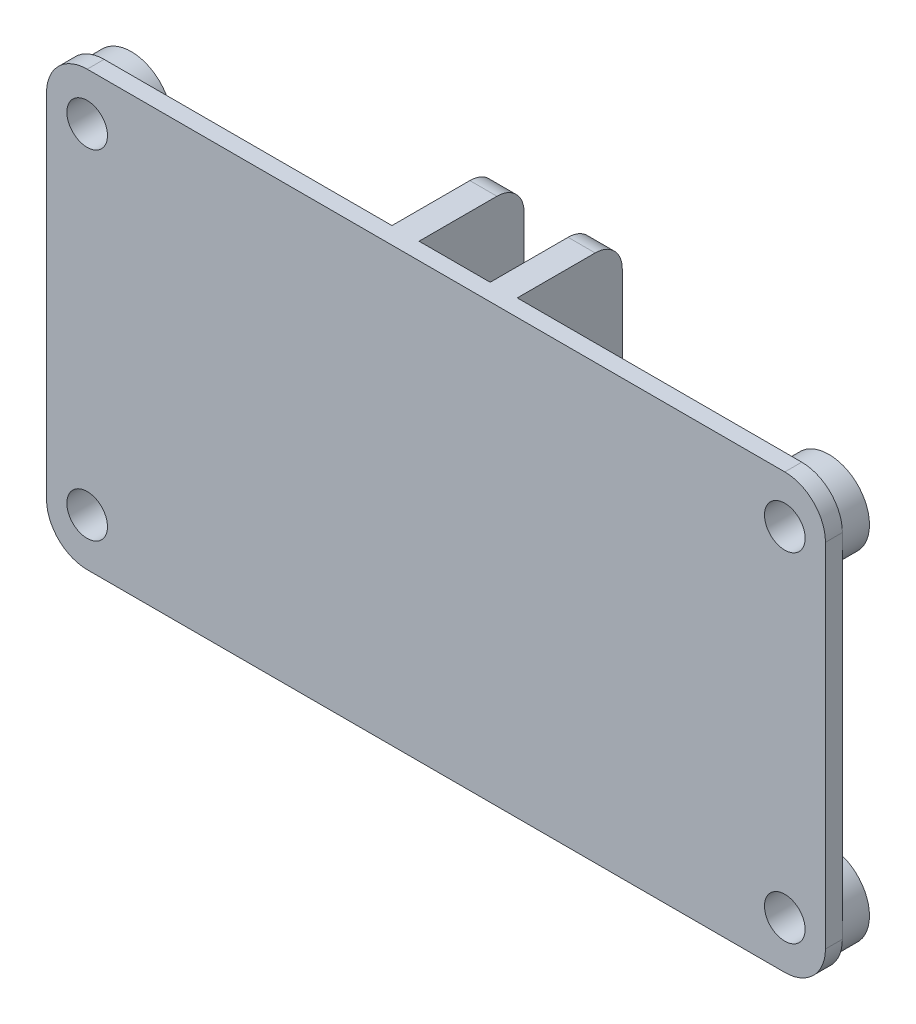
ISO-10303-21;
HEADER;
FILE_DESCRIPTION(('STEP AP214'),'2;1');
FILE_NAME('part.step','',(''),(''),'','','');
FILE_SCHEMA(('AUTOMOTIVE_DESIGN { 1 0 10303 214 1 1 1 1 }'));
ENDSEC;
DATA;
#1=APPLICATION_CONTEXT('core data for automotive mechanical design processes');
#2=APPLICATION_PROTOCOL_DEFINITION('international standard','automotive_design',2000,#1);
#3=PRODUCT_CONTEXT('',#1,'mechanical');
#4=PRODUCT('Part','Part','',(#3));
#5=PRODUCT_RELATED_PRODUCT_CATEGORY('part','',(#4));
#6=PRODUCT_DEFINITION_FORMATION('','',#4);
#7=PRODUCT_DEFINITION_CONTEXT('part definition',#1,'design');
#8=PRODUCT_DEFINITION('design','',#6,#7);
#9=PRODUCT_DEFINITION_SHAPE('','',#8);
#10=(LENGTH_UNIT() NAMED_UNIT(*) SI_UNIT(.MILLI.,.METRE.));
#11=(NAMED_UNIT(*) PLANE_ANGLE_UNIT() SI_UNIT($,.RADIAN.));
#12=(NAMED_UNIT(*) SI_UNIT($,.STERADIAN.) SOLID_ANGLE_UNIT());
#13=UNCERTAINTY_MEASURE_WITH_UNIT(LENGTH_MEASURE(1.E-05),#10,'distance_accuracy_value','');
#14=(GEOMETRIC_REPRESENTATION_CONTEXT(3) GLOBAL_UNCERTAINTY_ASSIGNED_CONTEXT((#13)) GLOBAL_UNIT_ASSIGNED_CONTEXT((#10,
#11,#12)) REPRESENTATION_CONTEXT('',''));
#15=CARTESIAN_POINT('',(0.,0.,0.));
#16=DIRECTION('',(0.,0.,1.));
#17=DIRECTION('',(1.,0.,0.));
#18=AXIS2_PLACEMENT_3D('',#15,#16,#17);
#19=CARTESIAN_POINT('',(0.,0.,9.));
#20=DIRECTION('',(1.,0.,0.));
#21=DIRECTION('',(0.,0.,-1.));
#22=AXIS2_PLACEMENT_3D('',#19,#20,#21);
#23=PLANE('',#22);
#24=DIRECTION('',(0.,1.,0.));
#25=VECTOR('',#24,1.);
#26=CARTESIAN_POINT('',(0.,32.,7.75));
#27=LINE('',#26,#25);
#28=CARTESIAN_POINT('',(0.,3.,7.75));
#29=VERTEX_POINT('',#28);
#30=CARTESIAN_POINT('',(0.,3.5,7.75));
#31=VERTEX_POINT('',#30);
#32=EDGE_CURVE('E214',#29,#31,#27,.T.);
#33=ORIENTED_EDGE('',*,*,#32,.F.);
#34=DIRECTION('',(0.,0.,-1.));
#35=VECTOR('',#34,1.);
#36=CARTESIAN_POINT('',(0.,3.,9.));
#37=LINE('',#36,#35);
#38=CARTESIAN_POINT('',(0.,3.,9.));
#39=VERTEX_POINT('',#38);
#40=EDGE_CURVE('E306',#29,#39,#37,.F.);
#41=ORIENTED_EDGE('',*,*,#40,.T.);
#42=DIRECTION('',(0.,-1.,0.));
#43=VECTOR('',#42,1.);
#44=CARTESIAN_POINT('',(0.,0.,9.));
#45=LINE('',#44,#43);
#46=CARTESIAN_POINT('',(0.,29.,9.));
#47=VERTEX_POINT('',#46);
#48=EDGE_CURVE('E221',#47,#39,#45,.T.);
#49=ORIENTED_EDGE('',*,*,#48,.F.);
#50=DIRECTION('',(0.,0.,-1.));
#51=VECTOR('',#50,1.);
#52=CARTESIAN_POINT('',(0.,29.,9.));
#53=LINE('',#52,#51);
#54=CARTESIAN_POINT('',(0.,29.,7.75));
#55=VERTEX_POINT('',#54);
#56=EDGE_CURVE('E303',#47,#55,#53,.T.);
#57=ORIENTED_EDGE('',*,*,#56,.T.);
#58=CARTESIAN_POINT('',(0.,28.5,7.75));
#59=VERTEX_POINT('',#58);
#60=EDGE_CURVE('E210',#59,#55,#27,.T.);
#61=ORIENTED_EDGE('',*,*,#60,.F.);
#62=EDGE_CURVE('E212',#31,#59,#27,.T.);
#63=ORIENTED_EDGE('',*,*,#62,.F.);
#64=EDGE_LOOP('',(#33,#41,#49,#57,#61,#63));
#65=FACE_BOUND('',#64,.T.);
#66=ADVANCED_FACE('F32',(#65),#23,.F.);
#67=CARTESIAN_POINT('',(57.5,0.,9.));
#68=DIRECTION('',(-1.,0.,0.));
#69=DIRECTION('',(0.,0.,1.));
#70=AXIS2_PLACEMENT_3D('',#67,#68,#69);
#71=PLANE('',#70);
#72=DIRECTION('',(0.,1.,0.));
#73=VECTOR('',#72,1.);
#74=CARTESIAN_POINT('',(57.5,0.,9.));
#75=LINE('',#74,#73);
#76=CARTESIAN_POINT('',(57.5,3.,9.));
#77=VERTEX_POINT('',#76);
#78=CARTESIAN_POINT('',(57.5,29.,9.));
#79=VERTEX_POINT('',#78);
#80=EDGE_CURVE('E280',#77,#79,#75,.T.);
#81=ORIENTED_EDGE('',*,*,#80,.F.);
#82=DIRECTION('',(0.,0.,-1.));
#83=VECTOR('',#82,1.);
#84=CARTESIAN_POINT('',(57.5,3.,9.));
#85=LINE('',#84,#83);
#86=CARTESIAN_POINT('',(57.5,3.,7.75));
#87=VERTEX_POINT('',#86);
#88=EDGE_CURVE('E318',#77,#87,#85,.T.);
#89=ORIENTED_EDGE('',*,*,#88,.T.);
#90=DIRECTION('',(0.,-1.,0.));
#91=VECTOR('',#90,1.);
#92=CARTESIAN_POINT('',(57.5,32.,7.75));
#93=LINE('',#92,#91);
#94=CARTESIAN_POINT('',(57.5,3.5,7.75));
#95=VERTEX_POINT('',#94);
#96=EDGE_CURVE('E228',#95,#87,#93,.T.);
#97=ORIENTED_EDGE('',*,*,#96,.F.);
#98=CARTESIAN_POINT('',(57.5,28.5,7.75));
#99=VERTEX_POINT('',#98);
#100=EDGE_CURVE('E227',#99,#95,#93,.T.);
#101=ORIENTED_EDGE('',*,*,#100,.F.);
#102=CARTESIAN_POINT('',(57.5,29.,7.75));
#103=VERTEX_POINT('',#102);
#104=EDGE_CURVE('E223',#103,#99,#93,.T.);
#105=ORIENTED_EDGE('',*,*,#104,.F.);
#106=DIRECTION('',(0.,0.,-1.));
#107=VECTOR('',#106,1.);
#108=CARTESIAN_POINT('',(57.5,29.,9.));
#109=LINE('',#108,#107);
#110=EDGE_CURVE('E316',#103,#79,#109,.F.);
#111=ORIENTED_EDGE('',*,*,#110,.T.);
#112=EDGE_LOOP('',(#81,#89,#97,#101,#105,#111));
#113=FACE_BOUND('',#112,.T.);
#114=ADVANCED_FACE('F429',(#113),#71,.F.);
#115=CARTESIAN_POINT('',(0.,0.,0.));
#116=DIRECTION('',(0.,0.,-1.));
#117=DIRECTION('',(-1.,0.,0.));
#118=AXIS2_PLACEMENT_3D('',#115,#116,#117);
#119=PLANE('',#118);
#120=DIRECTION('',(0.,1.,0.));
#121=VECTOR('',#120,1.);
#122=CARTESIAN_POINT('',(26.25,32.,0.));
#123=LINE('',#122,#121);
#124=CARTESIAN_POINT('',(26.25,2.,0.));
#125=VERTEX_POINT('',#124);
#126=CARTESIAN_POINT('',(26.25,30.,0.));
#127=VERTEX_POINT('',#126);
#128=EDGE_CURVE('E259',#125,#127,#123,.T.);
#129=ORIENTED_EDGE('',*,*,#128,.F.);
#130=DIRECTION('',(1.,0.,0.));
#131=VECTOR('',#130,1.);
#132=CARTESIAN_POINT('',(24.25,2.,0.));
#133=LINE('',#132,#131);
#134=CARTESIAN_POINT('',(24.25,2.,0.));
#135=VERTEX_POINT('',#134);
#136=EDGE_CURVE('E341',#125,#135,#133,.F.);
#137=ORIENTED_EDGE('',*,*,#136,.T.);
#138=DIRECTION('',(0.,-1.,0.));
#139=VECTOR('',#138,1.);
#140=CARTESIAN_POINT('',(24.25,32.,0.));
#141=LINE('',#140,#139);
#142=CARTESIAN_POINT('',(24.25,30.,0.));
#143=VERTEX_POINT('',#142);
#144=EDGE_CURVE('E203',#143,#135,#141,.T.);
#145=ORIENTED_EDGE('',*,*,#144,.F.);
#146=DIRECTION('',(-1.,0.,0.));
#147=VECTOR('',#146,1.);
#148=CARTESIAN_POINT('',(26.25,30.,0.));
#149=LINE('',#148,#147);
#150=EDGE_CURVE('E339',#143,#127,#149,.F.);
#151=ORIENTED_EDGE('',*,*,#150,.T.);
#152=EDGE_LOOP('',(#129,#137,#145,#151));
#153=FACE_BOUND('',#152,.T.);
#154=ADVANCED_FACE('F435',(#153),#119,.T.);
#155=CARTESIAN_POINT('',(0.,0.,9.));
#156=DIRECTION('',(0.,1.,0.));
#157=DIRECTION('',(0.,0.,1.));
#158=AXIS2_PLACEMENT_3D('',#155,#156,#157);
#159=PLANE('',#158);
#160=DIRECTION('',(0.,0.,-1.));
#161=VECTOR('',#160,1.);
#162=CARTESIAN_POINT('',(24.25,0.,7.75));
#163=LINE('',#162,#161);
#164=CARTESIAN_POINT('',(24.25,0.,7.75));
#165=VERTEX_POINT('',#164);
#166=CARTESIAN_POINT('',(24.25,0.,2.));
#167=VERTEX_POINT('',#166);
#168=EDGE_CURVE('E181',#165,#167,#163,.T.);
#169=ORIENTED_EDGE('',*,*,#168,.T.);
#170=DIRECTION('',(1.,0.,0.));
#171=VECTOR('',#170,1.);
#172=CARTESIAN_POINT('',(26.25,0.,2.));
#173=LINE('',#172,#171);
#174=CARTESIAN_POINT('',(26.25,0.,2.));
#175=VERTEX_POINT('',#174);
#176=EDGE_CURVE('E333',#167,#175,#173,.T.);
#177=ORIENTED_EDGE('',*,*,#176,.T.);
#178=DIRECTION('',(0.,0.,-1.));
#179=VECTOR('',#178,1.);
#180=CARTESIAN_POINT('',(26.25,0.,7.75));
#181=LINE('',#180,#179);
#182=CARTESIAN_POINT('',(26.25,0.,7.75));
#183=VERTEX_POINT('',#182);
#184=EDGE_CURVE('E240',#183,#175,#181,.T.);
#185=ORIENTED_EDGE('',*,*,#184,.F.);
#186=DIRECTION('',(-1.,0.,0.));
#187=VECTOR('',#186,1.);
#188=CARTESIAN_POINT('',(26.25,0.,7.75));
#189=LINE('',#188,#187);
#190=CARTESIAN_POINT('',(31.5,0.,7.75));
#191=VERTEX_POINT('',#190);
#192=EDGE_CURVE('E255',#191,#183,#189,.T.);
#193=ORIENTED_EDGE('',*,*,#192,.F.);
#194=DIRECTION('',(0.,0.,-1.));
#195=VECTOR('',#194,1.);
#196=CARTESIAN_POINT('',(31.5,0.,7.75));
#197=LINE('',#196,#195);
#198=CARTESIAN_POINT('',(31.5,0.,2.));
#199=VERTEX_POINT('',#198);
#200=EDGE_CURVE('E267',#191,#199,#197,.T.);
#201=ORIENTED_EDGE('',*,*,#200,.T.);
#202=DIRECTION('',(1.,0.,0.));
#203=VECTOR('',#202,1.);
#204=CARTESIAN_POINT('',(33.5,0.,2.));
#205=LINE('',#204,#203);
#206=CARTESIAN_POINT('',(33.5,0.,2.));
#207=VERTEX_POINT('',#206);
#208=EDGE_CURVE('E330',#199,#207,#205,.T.);
#209=ORIENTED_EDGE('',*,*,#208,.T.);
#210=DIRECTION('',(0.,0.,-1.));
#211=VECTOR('',#210,1.);
#212=CARTESIAN_POINT('',(33.5,0.,7.75));
#213=LINE('',#212,#211);
#214=CARTESIAN_POINT('',(33.5,0.,7.75));
#215=VERTEX_POINT('',#214);
#216=EDGE_CURVE('E236',#215,#207,#213,.T.);
#217=ORIENTED_EDGE('',*,*,#216,.F.);
#218=DIRECTION('',(-1.,0.,0.));
#219=VECTOR('',#218,1.);
#220=CARTESIAN_POINT('',(57.5,0.,7.75));
#221=LINE('',#220,#219);
#222=CARTESIAN_POINT('',(54.5,0.,7.75));
#223=VERTEX_POINT('',#222);
#224=EDGE_CURVE('E226',#223,#215,#221,.T.);
#225=ORIENTED_EDGE('',*,*,#224,.F.);
#226=DIRECTION('',(0.,0.,-1.));
#227=VECTOR('',#226,1.);
#228=CARTESIAN_POINT('',(54.5,0.,9.));
#229=LINE('',#228,#227);
#230=CARTESIAN_POINT('',(54.5,0.,9.));
#231=VERTEX_POINT('',#230);
#232=EDGE_CURVE('E286',#223,#231,#229,.F.);
#233=ORIENTED_EDGE('',*,*,#232,.T.);
#234=DIRECTION('',(1.,0.,0.));
#235=VECTOR('',#234,1.);
#236=CARTESIAN_POINT('',(0.,0.,9.));
#237=LINE('',#236,#235);
#238=CARTESIAN_POINT('',(3.,0.,9.));
#239=VERTEX_POINT('',#238);
#240=EDGE_CURVE('E277',#239,#231,#237,.T.);
#241=ORIENTED_EDGE('',*,*,#240,.F.);
#242=DIRECTION('',(0.,0.,-1.));
#243=VECTOR('',#242,1.);
#244=CARTESIAN_POINT('',(3.,0.,9.));
#245=LINE('',#244,#243);
#246=CARTESIAN_POINT('',(3.00000000000001,0.,7.75));
#247=VERTEX_POINT('',#246);
#248=EDGE_CURVE('E209',#239,#247,#245,.T.);
#249=ORIENTED_EDGE('',*,*,#248,.T.);
#250=DIRECTION('',(-1.,0.,0.));
#251=VECTOR('',#250,1.);
#252=CARTESIAN_POINT('',(24.25,0.,7.75));
#253=LINE('',#252,#251);
#254=EDGE_CURVE('E201',#165,#247,#253,.T.);
#255=ORIENTED_EDGE('',*,*,#254,.F.);
#256=EDGE_LOOP('',(#169,#177,#185,#193,#201,#209,#217,#225,#233,#241,#249,#255));
#257=FACE_BOUND('',#256,.T.);
#258=ADVANCED_FACE('F206',(#257),#159,.F.);
#259=CARTESIAN_POINT('',(0.,32.,9.));
#260=DIRECTION('',(0.,-1.,0.));
#261=DIRECTION('',(0.,0.,-1.));
#262=AXIS2_PLACEMENT_3D('',#259,#260,#261);
#263=PLANE('',#262);
#264=DIRECTION('',(0.,0.,-1.));
#265=VECTOR('',#264,1.);
#266=CARTESIAN_POINT('',(26.25,32.,7.75));
#267=LINE('',#266,#265);
#268=CARTESIAN_POINT('',(26.25,32.,7.75));
#269=VERTEX_POINT('',#268);
#270=CARTESIAN_POINT('',(26.25,32.,2.));
#271=VERTEX_POINT('',#270);
#272=EDGE_CURVE('E258',#269,#271,#267,.T.);
#273=ORIENTED_EDGE('',*,*,#272,.T.);
#274=DIRECTION('',(-1.,0.,0.));
#275=VECTOR('',#274,1.);
#276=CARTESIAN_POINT('',(24.25,32.,2.));
#277=LINE('',#276,#275);
#278=CARTESIAN_POINT('',(24.25,32.,2.));
#279=VERTEX_POINT('',#278);
#280=EDGE_CURVE('E11',#271,#279,#277,.T.);
#281=ORIENTED_EDGE('',*,*,#280,.T.);
#282=DIRECTION('',(0.,0.,-1.));
#283=VECTOR('',#282,1.);
#284=CARTESIAN_POINT('',(24.25,32.,7.75));
#285=LINE('',#284,#283);
#286=CARTESIAN_POINT('',(24.25,32.,7.75));
#287=VERTEX_POINT('',#286);
#288=EDGE_CURVE('E194',#287,#279,#285,.T.);
#289=ORIENTED_EDGE('',*,*,#288,.F.);
#290=DIRECTION('',(1.,0.,0.));
#291=VECTOR('',#290,1.);
#292=CARTESIAN_POINT('',(24.25,32.,7.75));
#293=LINE('',#292,#291);
#294=CARTESIAN_POINT('',(3.00000000000001,32.,7.75));
#295=VERTEX_POINT('',#294);
#296=EDGE_CURVE('E195',#295,#287,#293,.T.);
#297=ORIENTED_EDGE('',*,*,#296,.F.);
#298=DIRECTION('',(0.,0.,-1.));
#299=VECTOR('',#298,1.);
#300=CARTESIAN_POINT('',(3.,32.,9.));
#301=LINE('',#300,#299);
#302=CARTESIAN_POINT('',(3.,32.,9.));
#303=VERTEX_POINT('',#302);
#304=EDGE_CURVE('E328',#295,#303,#301,.F.);
#305=ORIENTED_EDGE('',*,*,#304,.T.);
#306=DIRECTION('',(-1.,0.,0.));
#307=VECTOR('',#306,1.);
#308=CARTESIAN_POINT('',(0.,32.,9.));
#309=LINE('',#308,#307);
#310=CARTESIAN_POINT('',(54.5,32.,9.));
#311=VERTEX_POINT('',#310);
#312=EDGE_CURVE('E283',#311,#303,#309,.T.);
#313=ORIENTED_EDGE('',*,*,#312,.F.);
#314=DIRECTION('',(0.,0.,-1.));
#315=VECTOR('',#314,1.);
#316=CARTESIAN_POINT('',(54.5,32.,9.));
#317=LINE('',#316,#315);
#318=CARTESIAN_POINT('',(54.5,32.,7.75));
#319=VERTEX_POINT('',#318);
#320=EDGE_CURVE('E325',#311,#319,#317,.T.);
#321=ORIENTED_EDGE('',*,*,#320,.T.);
#322=DIRECTION('',(1.,0.,0.));
#323=VECTOR('',#322,1.);
#324=CARTESIAN_POINT('',(57.5,32.,7.75));
#325=LINE('',#324,#323);
#326=CARTESIAN_POINT('',(33.5,32.,7.75));
#327=VERTEX_POINT('',#326);
#328=EDGE_CURVE('E233',#327,#319,#325,.T.);
#329=ORIENTED_EDGE('',*,*,#328,.F.);
#330=DIRECTION('',(0.,0.,-1.));
#331=VECTOR('',#330,1.);
#332=CARTESIAN_POINT('',(33.5,32.,7.75));
#333=LINE('',#332,#331);
#334=CARTESIAN_POINT('',(33.5,32.,2.));
#335=VERTEX_POINT('',#334);
#336=EDGE_CURVE('E220',#327,#335,#333,.T.);
#337=ORIENTED_EDGE('',*,*,#336,.T.);
#338=DIRECTION('',(-1.,0.,0.));
#339=VECTOR('',#338,1.);
#340=CARTESIAN_POINT('',(31.5,32.,2.));
#341=LINE('',#340,#339);
#342=CARTESIAN_POINT('',(31.5,32.,2.));
#343=VERTEX_POINT('',#342);
#344=EDGE_CURVE('E41',#335,#343,#341,.T.);
#345=ORIENTED_EDGE('',*,*,#344,.T.);
#346=DIRECTION('',(0.,0.,-1.));
#347=VECTOR('',#346,1.);
#348=CARTESIAN_POINT('',(31.5,32.,7.75));
#349=LINE('',#348,#347);
#350=CARTESIAN_POINT('',(31.5,32.,7.75));
#351=VERTEX_POINT('',#350);
#352=EDGE_CURVE('E270',#351,#343,#349,.T.);
#353=ORIENTED_EDGE('',*,*,#352,.F.);
#354=DIRECTION('',(1.,0.,0.));
#355=VECTOR('',#354,1.);
#356=CARTESIAN_POINT('',(26.25,32.,7.75));
#357=LINE('',#356,#355);
#358=EDGE_CURVE('E248',#269,#351,#357,.T.);
#359=ORIENTED_EDGE('',*,*,#358,.F.);
#360=EDGE_LOOP('',(#273,#281,#289,#297,#305,#313,#321,#329,#337,#345,#353,#359));
#361=FACE_BOUND('',#360,.T.);
#362=ADVANCED_FACE('F478',(#361),#263,.F.);
#363=CARTESIAN_POINT('',(0.,0.,9.));
#364=DIRECTION('',(0.,0.,-1.));
#365=DIRECTION('',(-1.,0.,0.));
#366=AXIS2_PLACEMENT_3D('',#363,#364,#365);
#367=PLANE('',#366);
#368=CARTESIAN_POINT('',(54.5,3.5,9.));
#369=DIRECTION('',(0.,0.,-1.));
#370=DIRECTION('',(-1.,0.,0.));
#371=AXIS2_PLACEMENT_3D('',#368,#369,#370);
#372=CIRCLE('',#371,1.5);
#373=CARTESIAN_POINT('',(53.,3.5,9.));
#374=VERTEX_POINT('',#373);
#375=EDGE_CURVE('E724',#374,#374,#372,.T.);
#376=ORIENTED_EDGE('',*,*,#375,.T.);
#377=EDGE_LOOP('',(#376));
#378=FACE_BOUND('',#377,.T.);
#379=CARTESIAN_POINT('',(3.,3.5,9.));
#380=DIRECTION('',(0.,0.,-1.));
#381=DIRECTION('',(-1.,0.,0.));
#382=AXIS2_PLACEMENT_3D('',#379,#380,#381);
#383=CIRCLE('',#382,1.5);
#384=CARTESIAN_POINT('',(1.5,3.5,9.));
#385=VERTEX_POINT('',#384);
#386=EDGE_CURVE('E721',#385,#385,#383,.T.);
#387=ORIENTED_EDGE('',*,*,#386,.T.);
#388=EDGE_LOOP('',(#387));
#389=FACE_BOUND('',#388,.T.);
#390=CARTESIAN_POINT('',(3.,28.5,9.));
#391=DIRECTION('',(0.,0.,-1.));
#392=DIRECTION('',(-1.,0.,0.));
#393=AXIS2_PLACEMENT_3D('',#390,#391,#392);
#394=CIRCLE('',#393,1.5);
#395=CARTESIAN_POINT('',(1.5,28.5,9.));
#396=VERTEX_POINT('',#395);
#397=EDGE_CURVE('E719',#396,#396,#394,.T.);
#398=ORIENTED_EDGE('',*,*,#397,.T.);
#399=EDGE_LOOP('',(#398));
#400=FACE_BOUND('',#399,.T.);
#401=CARTESIAN_POINT('',(54.5,28.5,9.));
#402=DIRECTION('',(0.,0.,-1.));
#403=DIRECTION('',(-1.,0.,0.));
#404=AXIS2_PLACEMENT_3D('',#401,#402,#403);
#405=CIRCLE('',#404,1.5);
#406=CARTESIAN_POINT('',(53.,28.5,9.));
#407=VERTEX_POINT('',#406);
#408=EDGE_CURVE('E364',#407,#407,#405,.T.);
#409=ORIENTED_EDGE('',*,*,#408,.T.);
#410=EDGE_LOOP('',(#409));
#411=FACE_BOUND('',#410,.T.);
#412=ORIENTED_EDGE('',*,*,#48,.T.);
#413=CARTESIAN_POINT('',(3.,3.,9.));
#414=DIRECTION('',(0.,0.,-1.));
#415=DIRECTION('',(-1.,0.,0.));
#416=AXIS2_PLACEMENT_3D('',#413,#414,#415);
#417=CIRCLE('',#416,3.);
#418=EDGE_CURVE('E314',#39,#239,#417,.F.);
#419=ORIENTED_EDGE('',*,*,#418,.T.);
#420=ORIENTED_EDGE('',*,*,#240,.T.);
#421=CARTESIAN_POINT('',(54.5,3.,9.));
#422=DIRECTION('',(0.,0.,-1.));
#423=DIRECTION('',(-1.,0.,0.));
#424=AXIS2_PLACEMENT_3D('',#421,#422,#423);
#425=CIRCLE('',#424,3.);
#426=EDGE_CURVE('E312',#231,#77,#425,.F.);
#427=ORIENTED_EDGE('',*,*,#426,.T.);
#428=ORIENTED_EDGE('',*,*,#80,.T.);
#429=CARTESIAN_POINT('',(54.5,29.,9.));
#430=DIRECTION('',(0.,0.,-1.));
#431=DIRECTION('',(-1.,0.,0.));
#432=AXIS2_PLACEMENT_3D('',#429,#430,#431);
#433=CIRCLE('',#432,3.);
#434=EDGE_CURVE('E308',#79,#311,#433,.F.);
#435=ORIENTED_EDGE('',*,*,#434,.T.);
#436=ORIENTED_EDGE('',*,*,#312,.T.);
#437=CARTESIAN_POINT('',(3.,29.,9.));
#438=DIRECTION('',(0.,0.,-1.));
#439=DIRECTION('',(-1.,0.,0.));
#440=AXIS2_PLACEMENT_3D('',#437,#438,#439);
#441=CIRCLE('',#440,3.);
#442=EDGE_CURVE('E310',#303,#47,#441,.F.);
#443=ORIENTED_EDGE('',*,*,#442,.T.);
#444=EDGE_LOOP('',(#412,#419,#420,#427,#428,#435,#436,#443));
#445=FACE_BOUND('',#444,.T.);
#446=ADVANCED_FACE('F494',(#378,#389,#400,#411,#445),#367,.F.);
#447=DIRECTION('',(0.,1.,0.));
#448=VECTOR('',#447,1.);
#449=CARTESIAN_POINT('',(33.5,32.,0.));
#450=LINE('',#449,#448);
#451=CARTESIAN_POINT('',(33.5,2.,0.));
#452=VERTEX_POINT('',#451);
#453=CARTESIAN_POINT('',(33.5,30.,0.));
#454=VERTEX_POINT('',#453);
#455=EDGE_CURVE('E237',#452,#454,#450,.T.);
#456=ORIENTED_EDGE('',*,*,#455,.F.);
#457=DIRECTION('',(1.,0.,0.));
#458=VECTOR('',#457,1.);
#459=CARTESIAN_POINT('',(31.5,2.,0.));
#460=LINE('',#459,#458);
#461=CARTESIAN_POINT('',(31.5,2.,0.));
#462=VERTEX_POINT('',#461);
#463=EDGE_CURVE('E352',#452,#462,#460,.F.);
#464=ORIENTED_EDGE('',*,*,#463,.T.);
#465=DIRECTION('',(0.,-1.,0.));
#466=VECTOR('',#465,1.);
#467=CARTESIAN_POINT('',(31.5,32.,0.));
#468=LINE('',#467,#466);
#469=CARTESIAN_POINT('',(31.5,30.,0.));
#470=VERTEX_POINT('',#469);
#471=EDGE_CURVE('E249',#470,#462,#468,.T.);
#472=ORIENTED_EDGE('',*,*,#471,.F.);
#473=DIRECTION('',(-1.,0.,0.));
#474=VECTOR('',#473,1.);
#475=CARTESIAN_POINT('',(33.5,30.,0.));
#476=LINE('',#475,#474);
#477=EDGE_CURVE('E350',#470,#454,#476,.F.);
#478=ORIENTED_EDGE('',*,*,#477,.T.);
#479=EDGE_LOOP('',(#456,#464,#472,#478));
#480=FACE_BOUND('',#479,.T.);
#481=ADVANCED_FACE('F525',(#480),#119,.T.);
#482=CARTESIAN_POINT('',(26.25,32.,7.75));
#483=DIRECTION('',(-1.,0.,0.));
#484=DIRECTION('',(0.,0.,1.));
#485=AXIS2_PLACEMENT_3D('',#482,#483,#484);
#486=PLANE('',#485);
#487=CARTESIAN_POINT('',(26.25,10.,3.5));
#488=DIRECTION('',(-1.,0.,0.));
#489=DIRECTION('',(0.,0.,1.));
#490=AXIS2_PLACEMENT_3D('',#487,#488,#489);
#491=CIRCLE('',#490,1.55000000000002);
#492=CARTESIAN_POINT('',(26.25,10.,5.05000000000002));
#493=VERTEX_POINT('',#492);
#494=EDGE_CURVE('E262',#493,#493,#491,.T.);
#495=ORIENTED_EDGE('',*,*,#494,.T.);
#496=EDGE_LOOP('',(#495));
#497=FACE_BOUND('',#496,.T.);
#498=CARTESIAN_POINT('',(26.25,20.,3.5));
#499=DIRECTION('',(-1.,0.,0.));
#500=DIRECTION('',(0.,0.,1.));
#501=AXIS2_PLACEMENT_3D('',#498,#499,#500);
#502=CIRCLE('',#501,1.55000000000002);
#503=CARTESIAN_POINT('',(26.25,20.,5.05000000000002));
#504=VERTEX_POINT('',#503);
#505=EDGE_CURVE('E296',#504,#504,#502,.T.);
#506=ORIENTED_EDGE('',*,*,#505,.T.);
#507=EDGE_LOOP('',(#506));
#508=FACE_BOUND('',#507,.T.);
#509=ORIENTED_EDGE('',*,*,#184,.T.);
#510=CARTESIAN_POINT('',(26.25,2.,2.));
#511=DIRECTION('',(-1.,0.,0.));
#512=DIRECTION('',(0.,0.,1.));
#513=AXIS2_PLACEMENT_3D('',#510,#511,#512);
#514=CIRCLE('',#513,2.);
#515=EDGE_CURVE('E337',#175,#125,#514,.F.);
#516=ORIENTED_EDGE('',*,*,#515,.T.);
#517=ORIENTED_EDGE('',*,*,#128,.T.);
#518=CARTESIAN_POINT('',(26.25,30.,2.));
#519=DIRECTION('',(-1.,0.,0.));
#520=DIRECTION('',(0.,0.,1.));
#521=AXIS2_PLACEMENT_3D('',#518,#519,#520);
#522=CIRCLE('',#521,2.);
#523=EDGE_CURVE('E335',#127,#271,#522,.F.);
#524=ORIENTED_EDGE('',*,*,#523,.T.);
#525=ORIENTED_EDGE('',*,*,#272,.F.);
#526=DIRECTION('',(0.,1.,0.));
#527=VECTOR('',#526,1.);
#528=CARTESIAN_POINT('',(26.25,32.,7.75));
#529=LINE('',#528,#527);
#530=EDGE_CURVE('E245',#183,#269,#529,.T.);
#531=ORIENTED_EDGE('',*,*,#530,.F.);
#532=EDGE_LOOP('',(#509,#516,#517,#524,#525,#531));
#533=FACE_BOUND('',#532,.T.);
#534=ADVANCED_FACE('F406',(#497,#508,#533),#486,.F.);
#535=CARTESIAN_POINT('',(31.5,32.,7.75));
#536=DIRECTION('',(1.,0.,0.));
#537=DIRECTION('',(0.,1.,0.));
#538=AXIS2_PLACEMENT_3D('',#535,#536,#537);
#539=PLANE('',#538);
#540=CARTESIAN_POINT('',(31.5,10.,3.5));
#541=DIRECTION('',(1.,0.,0.));
#542=DIRECTION('',(0.,1.,0.));
#543=AXIS2_PLACEMENT_3D('',#540,#541,#542);
#544=CIRCLE('',#543,1.55000000000002);
#545=CARTESIAN_POINT('',(31.5,11.55,3.5));
#546=VERTEX_POINT('',#545);
#547=EDGE_CURVE('E295',#546,#546,#544,.T.);
#548=ORIENTED_EDGE('',*,*,#547,.T.);
#549=EDGE_LOOP('',(#548));
#550=FACE_BOUND('',#549,.T.);
#551=CARTESIAN_POINT('',(31.5,20.,3.5));
#552=DIRECTION('',(1.,0.,0.));
#553=DIRECTION('',(0.,1.,0.));
#554=AXIS2_PLACEMENT_3D('',#551,#552,#553);
#555=CIRCLE('',#554,1.55000000000002);
#556=CARTESIAN_POINT('',(31.5,21.55,3.5));
#557=VERTEX_POINT('',#556);
#558=EDGE_CURVE('E290',#557,#557,#555,.T.);
#559=ORIENTED_EDGE('',*,*,#558,.T.);
#560=EDGE_LOOP('',(#559));
#561=FACE_BOUND('',#560,.T.);
#562=ORIENTED_EDGE('',*,*,#471,.T.);
#563=CARTESIAN_POINT('',(31.5,2.,2.));
#564=DIRECTION('',(1.,0.,0.));
#565=DIRECTION('',(0.,1.,0.));
#566=AXIS2_PLACEMENT_3D('',#563,#564,#565);
#567=CIRCLE('',#566,2.);
#568=EDGE_CURVE('E356',#462,#199,#567,.F.);
#569=ORIENTED_EDGE('',*,*,#568,.T.);
#570=ORIENTED_EDGE('',*,*,#200,.F.);
#571=DIRECTION('',(0.,-1.,0.));
#572=VECTOR('',#571,1.);
#573=CARTESIAN_POINT('',(31.5,32.,7.75));
#574=LINE('',#573,#572);
#575=EDGE_CURVE('E252',#351,#191,#574,.T.);
#576=ORIENTED_EDGE('',*,*,#575,.F.);
#577=ORIENTED_EDGE('',*,*,#352,.T.);
#578=CARTESIAN_POINT('',(31.5,30.,2.));
#579=DIRECTION('',(1.,0.,0.));
#580=DIRECTION('',(0.,1.,0.));
#581=AXIS2_PLACEMENT_3D('',#578,#579,#580);
#582=CIRCLE('',#581,2.);
#583=EDGE_CURVE('E354',#343,#470,#582,.F.);
#584=ORIENTED_EDGE('',*,*,#583,.T.);
#585=EDGE_LOOP('',(#562,#569,#570,#576,#577,#584));
#586=FACE_BOUND('',#585,.T.);
#587=ADVANCED_FACE('F530',(#550,#561,#586),#539,.F.);
#588=CARTESIAN_POINT('',(0.,0.,7.75));
#589=DIRECTION('',(0.,0.,1.));
#590=DIRECTION('',(1.,0.,0.));
#591=AXIS2_PLACEMENT_3D('',#588,#589,#590);
#592=PLANE('',#591);
#593=ORIENTED_EDGE('',*,*,#530,.T.);
#594=ORIENTED_EDGE('',*,*,#358,.T.);
#595=ORIENTED_EDGE('',*,*,#575,.T.);
#596=ORIENTED_EDGE('',*,*,#192,.T.);
#597=EDGE_LOOP('',(#593,#594,#595,#596));
#598=FACE_BOUND('',#597,.T.);
#599=ADVANCED_FACE('F481',(#598),#592,.F.);
#600=CARTESIAN_POINT('',(33.5,32.,7.75));
#601=DIRECTION('',(-1.,0.,0.));
#602=DIRECTION('',(0.,0.,1.));
#603=AXIS2_PLACEMENT_3D('',#600,#601,#602);
#604=PLANE('',#603);
#605=CARTESIAN_POINT('',(33.5,10.,3.5));
#606=DIRECTION('',(1.,0.,0.));
#607=DIRECTION('',(0.,1.,0.));
#608=AXIS2_PLACEMENT_3D('',#605,#606,#607);
#609=CIRCLE('',#608,1.55000000000002);
#610=CARTESIAN_POINT('',(33.5,11.55,3.5));
#611=VERTEX_POINT('',#610);
#612=EDGE_CURVE('E291',#611,#611,#609,.T.);
#613=ORIENTED_EDGE('',*,*,#612,.F.);
#614=EDGE_LOOP('',(#613));
#615=FACE_BOUND('',#614,.T.);
#616=CARTESIAN_POINT('',(33.5,20.,3.5));
#617=DIRECTION('',(1.,0.,0.));
#618=DIRECTION('',(0.,1.,0.));
#619=AXIS2_PLACEMENT_3D('',#616,#617,#618);
#620=CIRCLE('',#619,1.55000000000002);
#621=CARTESIAN_POINT('',(33.5,21.55,3.5));
#622=VERTEX_POINT('',#621);
#623=EDGE_CURVE('E392',#622,#622,#620,.T.);
#624=ORIENTED_EDGE('',*,*,#623,.F.);
#625=EDGE_LOOP('',(#624));
#626=FACE_BOUND('',#625,.T.);
#627=ORIENTED_EDGE('',*,*,#216,.T.);
#628=CARTESIAN_POINT('',(33.5,2.,2.));
#629=DIRECTION('',(-1.,0.,0.));
#630=DIRECTION('',(0.,0.,1.));
#631=AXIS2_PLACEMENT_3D('',#628,#629,#630);
#632=CIRCLE('',#631,2.);
#633=EDGE_CURVE('E348',#207,#452,#632,.F.);
#634=ORIENTED_EDGE('',*,*,#633,.T.);
#635=ORIENTED_EDGE('',*,*,#455,.T.);
#636=CARTESIAN_POINT('',(33.5,30.,2.));
#637=DIRECTION('',(-1.,0.,0.));
#638=DIRECTION('',(0.,0.,1.));
#639=AXIS2_PLACEMENT_3D('',#636,#637,#638);
#640=CIRCLE('',#639,2.);
#641=EDGE_CURVE('E346',#454,#335,#640,.F.);
#642=ORIENTED_EDGE('',*,*,#641,.T.);
#643=ORIENTED_EDGE('',*,*,#336,.F.);
#644=DIRECTION('',(0.,1.,0.));
#645=VECTOR('',#644,1.);
#646=CARTESIAN_POINT('',(33.5,32.,7.75));
#647=LINE('',#646,#645);
#648=EDGE_CURVE('E230',#215,#327,#647,.T.);
#649=ORIENTED_EDGE('',*,*,#648,.F.);
#650=EDGE_LOOP('',(#627,#634,#635,#642,#643,#649));
#651=FACE_BOUND('',#650,.T.);
#652=ADVANCED_FACE('F518',(#615,#626,#651),#604,.F.);
#653=CARTESIAN_POINT('',(0.,0.,7.75));
#654=DIRECTION('',(0.,0.,-1.));
#655=DIRECTION('',(-1.,0.,0.));
#656=AXIS2_PLACEMENT_3D('',#653,#654,#655);
#657=PLANE('',#656);
#658=ORIENTED_EDGE('',*,*,#100,.T.);
#659=CARTESIAN_POINT('',(54.5,3.5,7.75));
#660=DIRECTION('',(0.,0.,-1.));
#661=DIRECTION('',(-1.,0.,0.));
#662=AXIS2_PLACEMENT_3D('',#659,#660,#661);
#663=CIRCLE('',#662,3.);
#664=EDGE_CURVE('E382',#95,#95,#663,.T.);
#665=ORIENTED_EDGE('',*,*,#664,.F.);
#666=ORIENTED_EDGE('',*,*,#96,.T.);
#667=CARTESIAN_POINT('',(54.5,3.,7.75));
#668=DIRECTION('',(0.,0.,-1.));
#669=DIRECTION('',(-1.,0.,0.));
#670=AXIS2_PLACEMENT_3D('',#667,#668,#669);
#671=CIRCLE('',#670,3.);
#672=EDGE_CURVE('E323',#87,#223,#671,.T.);
#673=ORIENTED_EDGE('',*,*,#672,.T.);
#674=ORIENTED_EDGE('',*,*,#224,.T.);
#675=ORIENTED_EDGE('',*,*,#648,.T.);
#676=ORIENTED_EDGE('',*,*,#328,.T.);
#677=CARTESIAN_POINT('',(54.5,29.,7.75));
#678=DIRECTION('',(0.,0.,-1.));
#679=DIRECTION('',(-1.,0.,0.));
#680=AXIS2_PLACEMENT_3D('',#677,#678,#679);
#681=CIRCLE('',#680,3.);
#682=EDGE_CURVE('E321',#319,#103,#681,.T.);
#683=ORIENTED_EDGE('',*,*,#682,.T.);
#684=ORIENTED_EDGE('',*,*,#104,.T.);
#685=CARTESIAN_POINT('',(54.5,28.5,7.75));
#686=DIRECTION('',(0.,0.,-1.));
#687=DIRECTION('',(-1.,0.,0.));
#688=AXIS2_PLACEMENT_3D('',#685,#686,#687);
#689=CIRCLE('',#688,3.);
#690=EDGE_CURVE('E387',#99,#99,#689,.T.);
#691=ORIENTED_EDGE('',*,*,#690,.F.);
#692=EDGE_LOOP('',(#658,#665,#666,#673,#674,#675,#676,#683,#684,#691));
#693=FACE_BOUND('',#692,.T.);
#694=ADVANCED_FACE('F515',(#693),#657,.T.);
#695=CARTESIAN_POINT('',(24.25,32.,7.75));
#696=DIRECTION('',(1.,0.,0.));
#697=DIRECTION('',(0.,0.,-1.));
#698=AXIS2_PLACEMENT_3D('',#695,#696,#697);
#699=PLANE('',#698);
#700=CARTESIAN_POINT('',(24.25,10.,3.5));
#701=DIRECTION('',(1.,0.,0.));
#702=DIRECTION('',(0.,0.,-1.));
#703=AXIS2_PLACEMENT_3D('',#700,#701,#702);
#704=CIRCLE('',#703,1.55000000000002);
#705=CARTESIAN_POINT('',(24.25,10.,1.94999999999998));
#706=VERTEX_POINT('',#705);
#707=EDGE_CURVE('E292',#706,#706,#704,.T.);
#708=ORIENTED_EDGE('',*,*,#707,.T.);
#709=EDGE_LOOP('',(#708));
#710=FACE_BOUND('',#709,.T.);
#711=CARTESIAN_POINT('',(24.25,20.,3.5));
#712=DIRECTION('',(1.,0.,0.));
#713=DIRECTION('',(0.,0.,-1.));
#714=AXIS2_PLACEMENT_3D('',#711,#712,#713);
#715=CIRCLE('',#714,1.55000000000002);
#716=CARTESIAN_POINT('',(24.25,20.,1.94999999999998));
#717=VERTEX_POINT('',#716);
#718=EDGE_CURVE('E287',#717,#717,#715,.T.);
#719=ORIENTED_EDGE('',*,*,#718,.T.);
#720=EDGE_LOOP('',(#719));
#721=FACE_BOUND('',#720,.T.);
#722=ORIENTED_EDGE('',*,*,#144,.T.);
#723=CARTESIAN_POINT('',(24.25,2.,2.));
#724=DIRECTION('',(1.,0.,0.));
#725=DIRECTION('',(0.,0.,-1.));
#726=AXIS2_PLACEMENT_3D('',#723,#724,#725);
#727=CIRCLE('',#726,2.);
#728=EDGE_CURVE('E189',#135,#167,#727,.F.);
#729=ORIENTED_EDGE('',*,*,#728,.T.);
#730=ORIENTED_EDGE('',*,*,#168,.F.);
#731=DIRECTION('',(0.,-1.,0.));
#732=VECTOR('',#731,1.);
#733=CARTESIAN_POINT('',(24.25,32.,7.75));
#734=LINE('',#733,#732);
#735=EDGE_CURVE('E186',#287,#165,#734,.T.);
#736=ORIENTED_EDGE('',*,*,#735,.F.);
#737=ORIENTED_EDGE('',*,*,#288,.T.);
#738=CARTESIAN_POINT('',(24.25,30.,2.));
#739=DIRECTION('',(1.,0.,0.));
#740=DIRECTION('',(0.,0.,-1.));
#741=AXIS2_PLACEMENT_3D('',#738,#739,#740);
#742=CIRCLE('',#741,2.);
#743=EDGE_CURVE('E343',#279,#143,#742,.F.);
#744=ORIENTED_EDGE('',*,*,#743,.T.);
#745=EDGE_LOOP('',(#722,#729,#730,#736,#737,#744));
#746=FACE_BOUND('',#745,.T.);
#747=ADVANCED_FACE('F184',(#710,#721,#746),#699,.F.);
#748=CARTESIAN_POINT('',(0.,0.,7.75));
#749=DIRECTION('',(0.,0.,-1.));
#750=DIRECTION('',(-1.,0.,0.));
#751=AXIS2_PLACEMENT_3D('',#748,#749,#750);
#752=PLANE('',#751);
#753=ORIENTED_EDGE('',*,*,#62,.T.);
#754=CARTESIAN_POINT('',(3.,28.5,7.75));
#755=DIRECTION('',(0.,0.,-1.));
#756=DIRECTION('',(-1.,0.,0.));
#757=AXIS2_PLACEMENT_3D('',#754,#755,#756);
#758=CIRCLE('',#757,3.);
#759=EDGE_CURVE('E47',#59,#59,#758,.T.);
#760=ORIENTED_EDGE('',*,*,#759,.F.);
#761=ORIENTED_EDGE('',*,*,#60,.T.);
#762=CARTESIAN_POINT('',(3.,29.,7.75));
#763=DIRECTION('',(0.,0.,-1.));
#764=DIRECTION('',(-1.,0.,0.));
#765=AXIS2_PLACEMENT_3D('',#762,#763,#764);
#766=CIRCLE('',#765,3.);
#767=EDGE_CURVE('E299',#55,#295,#766,.T.);
#768=ORIENTED_EDGE('',*,*,#767,.T.);
#769=ORIENTED_EDGE('',*,*,#296,.T.);
#770=ORIENTED_EDGE('',*,*,#735,.T.);
#771=ORIENTED_EDGE('',*,*,#254,.T.);
#772=CARTESIAN_POINT('',(3.,3.,7.75));
#773=DIRECTION('',(0.,0.,-1.));
#774=DIRECTION('',(-1.,0.,0.));
#775=AXIS2_PLACEMENT_3D('',#772,#773,#774);
#776=CIRCLE('',#775,3.);
#777=EDGE_CURVE('E301',#247,#29,#776,.T.);
#778=ORIENTED_EDGE('',*,*,#777,.T.);
#779=ORIENTED_EDGE('',*,*,#32,.T.);
#780=CARTESIAN_POINT('',(3.,3.5,7.75));
#781=DIRECTION('',(0.,0.,-1.));
#782=DIRECTION('',(-1.,0.,0.));
#783=AXIS2_PLACEMENT_3D('',#780,#781,#782);
#784=CIRCLE('',#783,3.);
#785=EDGE_CURVE('E52',#31,#31,#784,.T.);
#786=ORIENTED_EDGE('',*,*,#785,.F.);
#787=EDGE_LOOP('',(#753,#760,#761,#768,#769,#770,#771,#778,#779,#786));
#788=FACE_BOUND('',#787,.T.);
#789=ADVANCED_FACE('F200',(#788),#752,.T.);
#790=CARTESIAN_POINT('',(0.,20.,3.5));
#791=DIRECTION('',(1.,0.,0.));
#792=DIRECTION('',(0.,1.,0.));
#793=AXIS2_PLACEMENT_3D('',#790,#791,#792);
#794=CYLINDRICAL_SURFACE('',#793,1.55000000000002);
#795=ORIENTED_EDGE('',*,*,#718,.F.);
#796=EDGE_LOOP('',(#795));
#797=FACE_BOUND('',#796,.T.);
#798=ORIENTED_EDGE('',*,*,#505,.F.);
#799=EDGE_LOOP('',(#798));
#800=FACE_BOUND('',#799,.T.);
#801=ADVANCED_FACE('F412',(#797,#800),#794,.F.);
#802=CARTESIAN_POINT('',(0.,10.,3.5));
#803=DIRECTION('',(1.,0.,0.));
#804=DIRECTION('',(0.,1.,0.));
#805=AXIS2_PLACEMENT_3D('',#802,#803,#804);
#806=CYLINDRICAL_SURFACE('',#805,1.55000000000002);
#807=ORIENTED_EDGE('',*,*,#707,.F.);
#808=EDGE_LOOP('',(#807));
#809=FACE_BOUND('',#808,.T.);
#810=ORIENTED_EDGE('',*,*,#494,.F.);
#811=EDGE_LOOP('',(#810));
#812=FACE_BOUND('',#811,.T.);
#813=ADVANCED_FACE('F409',(#809,#812),#806,.F.);
#814=ORIENTED_EDGE('',*,*,#623,.T.);
#815=EDGE_LOOP('',(#814));
#816=FACE_BOUND('',#815,.T.);
#817=ORIENTED_EDGE('',*,*,#558,.F.);
#818=EDGE_LOOP('',(#817));
#819=FACE_BOUND('',#818,.T.);
#820=ADVANCED_FACE('F411',(#816,#819),#794,.F.);
#821=ORIENTED_EDGE('',*,*,#612,.T.);
#822=EDGE_LOOP('',(#821));
#823=FACE_BOUND('',#822,.T.);
#824=ORIENTED_EDGE('',*,*,#547,.F.);
#825=EDGE_LOOP('',(#824));
#826=FACE_BOUND('',#825,.T.);
#827=ADVANCED_FACE('F415',(#823,#826),#806,.F.);
#828=CARTESIAN_POINT('',(3.,3.,9.));
#829=DIRECTION('',(0.,0.,-1.));
#830=DIRECTION('',(-1.,0.,0.));
#831=AXIS2_PLACEMENT_3D('',#828,#829,#830);
#832=CYLINDRICAL_SURFACE('',#831,3.);
#833=ORIENTED_EDGE('',*,*,#418,.F.);
#834=ORIENTED_EDGE('',*,*,#40,.F.);
#835=ORIENTED_EDGE('',*,*,#777,.F.);
#836=ORIENTED_EDGE('',*,*,#248,.F.);
#837=EDGE_LOOP('',(#833,#834,#835,#836));
#838=FACE_BOUND('',#837,.T.);
#839=ADVANCED_FACE('F426',(#838),#832,.T.);
#840=CARTESIAN_POINT('',(54.5,3.,9.));
#841=DIRECTION('',(0.,0.,-1.));
#842=DIRECTION('',(-1.,0.,0.));
#843=AXIS2_PLACEMENT_3D('',#840,#841,#842);
#844=CYLINDRICAL_SURFACE('',#843,3.);
#845=ORIENTED_EDGE('',*,*,#426,.F.);
#846=ORIENTED_EDGE('',*,*,#232,.F.);
#847=ORIENTED_EDGE('',*,*,#672,.F.);
#848=ORIENTED_EDGE('',*,*,#88,.F.);
#849=EDGE_LOOP('',(#845,#846,#847,#848));
#850=FACE_BOUND('',#849,.T.);
#851=ADVANCED_FACE('F443',(#850),#844,.T.);
#852=CARTESIAN_POINT('',(3.,29.,9.));
#853=DIRECTION('',(0.,0.,-1.));
#854=DIRECTION('',(-1.,0.,0.));
#855=AXIS2_PLACEMENT_3D('',#852,#853,#854);
#856=CYLINDRICAL_SURFACE('',#855,3.);
#857=ORIENTED_EDGE('',*,*,#442,.F.);
#858=ORIENTED_EDGE('',*,*,#304,.F.);
#859=ORIENTED_EDGE('',*,*,#767,.F.);
#860=ORIENTED_EDGE('',*,*,#56,.F.);
#861=EDGE_LOOP('',(#857,#858,#859,#860));
#862=FACE_BOUND('',#861,.T.);
#863=ADVANCED_FACE('F447',(#862),#856,.T.);
#864=CARTESIAN_POINT('',(54.5,29.,9.));
#865=DIRECTION('',(0.,0.,-1.));
#866=DIRECTION('',(-1.,0.,0.));
#867=AXIS2_PLACEMENT_3D('',#864,#865,#866);
#868=CYLINDRICAL_SURFACE('',#867,3.);
#869=ORIENTED_EDGE('',*,*,#434,.F.);
#870=ORIENTED_EDGE('',*,*,#110,.F.);
#871=ORIENTED_EDGE('',*,*,#682,.F.);
#872=ORIENTED_EDGE('',*,*,#320,.F.);
#873=EDGE_LOOP('',(#869,#870,#871,#872));
#874=FACE_BOUND('',#873,.T.);
#875=ADVANCED_FACE('F451',(#874),#868,.T.);
#876=CARTESIAN_POINT('',(0.,2.,2.));
#877=DIRECTION('',(-1.,0.,0.));
#878=DIRECTION('',(0.,0.,1.));
#879=AXIS2_PLACEMENT_3D('',#876,#877,#878);
#880=CYLINDRICAL_SURFACE('',#879,2.);
#881=ORIENTED_EDGE('',*,*,#728,.F.);
#882=ORIENTED_EDGE('',*,*,#136,.F.);
#883=ORIENTED_EDGE('',*,*,#515,.F.);
#884=ORIENTED_EDGE('',*,*,#176,.F.);
#885=EDGE_LOOP('',(#881,#882,#883,#884));
#886=FACE_BOUND('',#885,.T.);
#887=ADVANCED_FACE('F455',(#886),#880,.T.);
#888=CARTESIAN_POINT('',(0.,2.,2.));
#889=DIRECTION('',(-1.,0.,0.));
#890=DIRECTION('',(0.,0.,1.));
#891=AXIS2_PLACEMENT_3D('',#888,#889,#890);
#892=CYLINDRICAL_SURFACE('',#891,2.);
#893=ORIENTED_EDGE('',*,*,#568,.F.);
#894=ORIENTED_EDGE('',*,*,#463,.F.);
#895=ORIENTED_EDGE('',*,*,#633,.F.);
#896=ORIENTED_EDGE('',*,*,#208,.F.);
#897=EDGE_LOOP('',(#893,#894,#895,#896));
#898=FACE_BOUND('',#897,.T.);
#899=ADVANCED_FACE('F459',(#898),#892,.T.);
#900=CARTESIAN_POINT('',(0.,30.,2.));
#901=DIRECTION('',(1.,0.,0.));
#902=DIRECTION('',(0.,0.,-1.));
#903=AXIS2_PLACEMENT_3D('',#900,#901,#902);
#904=CYLINDRICAL_SURFACE('',#903,2.);
#905=ORIENTED_EDGE('',*,*,#523,.F.);
#906=ORIENTED_EDGE('',*,*,#150,.F.);
#907=ORIENTED_EDGE('',*,*,#743,.F.);
#908=ORIENTED_EDGE('',*,*,#280,.F.);
#909=EDGE_LOOP('',(#905,#906,#907,#908));
#910=FACE_BOUND('',#909,.T.);
#911=ADVANCED_FACE('F462',(#910),#904,.T.);
#912=CARTESIAN_POINT('',(0.,30.,2.));
#913=DIRECTION('',(1.,0.,0.));
#914=DIRECTION('',(0.,0.,-1.));
#915=AXIS2_PLACEMENT_3D('',#912,#913,#914);
#916=CYLINDRICAL_SURFACE('',#915,2.);
#917=ORIENTED_EDGE('',*,*,#641,.F.);
#918=ORIENTED_EDGE('',*,*,#477,.F.);
#919=ORIENTED_EDGE('',*,*,#583,.F.);
#920=ORIENTED_EDGE('',*,*,#344,.F.);
#921=EDGE_LOOP('',(#917,#918,#919,#920));
#922=FACE_BOUND('',#921,.T.);
#923=ADVANCED_FACE('F34',(#922),#916,.T.);
#924=CARTESIAN_POINT('',(54.5,28.5,5.75));
#925=DIRECTION('',(0.,0.,1.));
#926=DIRECTION('',(1.,0.,0.));
#927=AXIS2_PLACEMENT_3D('',#924,#925,#926);
#928=CYLINDRICAL_SURFACE('',#927,3.);
#929=CARTESIAN_POINT('',(54.5,28.5,5.75));
#930=DIRECTION('',(0.,0.,-1.));
#931=DIRECTION('',(-1.,0.,0.));
#932=AXIS2_PLACEMENT_3D('',#929,#930,#931);
#933=CIRCLE('',#932,3.);
#934=CARTESIAN_POINT('',(51.5,28.5,5.75));
#935=VERTEX_POINT('',#934);
#936=EDGE_CURVE('E389',#935,#935,#933,.T.);
#937=ORIENTED_EDGE('',*,*,#936,.F.);
#938=EDGE_LOOP('',(#937));
#939=FACE_BOUND('',#938,.T.);
#940=ORIENTED_EDGE('',*,*,#690,.T.);
#941=EDGE_LOOP('',(#940));
#942=FACE_BOUND('',#941,.T.);
#943=ADVANCED_FACE('F469',(#939,#942),#928,.T.);
#944=CARTESIAN_POINT('',(54.5,28.5,5.75));
#945=DIRECTION('',(0.,0.,-1.));
#946=DIRECTION('',(-1.,0.,0.));
#947=AXIS2_PLACEMENT_3D('',#944,#945,#946);
#948=PLANE('',#947);
#949=CARTESIAN_POINT('',(54.5,28.5,5.75));
#950=DIRECTION('',(0.,0.,-1.));
#951=DIRECTION('',(-1.,0.,0.));
#952=AXIS2_PLACEMENT_3D('',#949,#950,#951);
#953=CIRCLE('',#952,1.5);
#954=CARTESIAN_POINT('',(53.,28.5,5.75));
#955=VERTEX_POINT('',#954);
#956=EDGE_CURVE('E36',#955,#955,#953,.T.);
#957=ORIENTED_EDGE('',*,*,#956,.F.);
#958=EDGE_LOOP('',(#957));
#959=FACE_BOUND('',#958,.T.);
#960=ORIENTED_EDGE('',*,*,#936,.T.);
#961=EDGE_LOOP('',(#960));
#962=FACE_BOUND('',#961,.T.);
#963=ADVANCED_FACE('F595',(#959,#962),#948,.T.);
#964=CARTESIAN_POINT('',(54.5,3.5,5.75));
#965=DIRECTION('',(0.,0.,1.));
#966=DIRECTION('',(1.,0.,0.));
#967=AXIS2_PLACEMENT_3D('',#964,#965,#966);
#968=CYLINDRICAL_SURFACE('',#967,3.);
#969=CARTESIAN_POINT('',(54.5,3.5,5.75));
#970=DIRECTION('',(0.,0.,-1.));
#971=DIRECTION('',(-1.,0.,0.));
#972=AXIS2_PLACEMENT_3D('',#969,#970,#971);
#973=CIRCLE('',#972,3.);
#974=CARTESIAN_POINT('',(51.5,3.5,5.75));
#975=VERTEX_POINT('',#974);
#976=EDGE_CURVE('E384',#975,#975,#973,.T.);
#977=ORIENTED_EDGE('',*,*,#976,.F.);
#978=EDGE_LOOP('',(#977));
#979=FACE_BOUND('',#978,.T.);
#980=ORIENTED_EDGE('',*,*,#664,.T.);
#981=EDGE_LOOP('',(#980));
#982=FACE_BOUND('',#981,.T.);
#983=ADVANCED_FACE('F603',(#979,#982),#968,.T.);
#984=CARTESIAN_POINT('',(54.5,3.5,5.75));
#985=DIRECTION('',(0.,0.,-1.));
#986=DIRECTION('',(-1.,0.,0.));
#987=AXIS2_PLACEMENT_3D('',#984,#985,#986);
#988=PLANE('',#987);
#989=CARTESIAN_POINT('',(54.5,3.5,5.75));
#990=DIRECTION('',(0.,0.,-1.));
#991=DIRECTION('',(-1.,0.,0.));
#992=AXIS2_PLACEMENT_3D('',#989,#990,#991);
#993=CIRCLE('',#992,1.5);
#994=CARTESIAN_POINT('',(53.,3.5,5.75));
#995=VERTEX_POINT('',#994);
#996=EDGE_CURVE('E366',#995,#995,#993,.T.);
#997=ORIENTED_EDGE('',*,*,#996,.F.);
#998=EDGE_LOOP('',(#997));
#999=FACE_BOUND('',#998,.T.);
#1000=ORIENTED_EDGE('',*,*,#976,.T.);
#1001=EDGE_LOOP('',(#1000));
#1002=FACE_BOUND('',#1001,.T.);
#1003=ADVANCED_FACE('F608',(#999,#1002),#988,.T.);
#1004=CARTESIAN_POINT('',(3.,3.5,5.75));
#1005=DIRECTION('',(0.,0.,1.));
#1006=DIRECTION('',(1.,0.,0.));
#1007=AXIS2_PLACEMENT_3D('',#1004,#1005,#1006);
#1008=CYLINDRICAL_SURFACE('',#1007,3.);
#1009=CARTESIAN_POINT('',(3.,3.5,5.75));
#1010=DIRECTION('',(0.,0.,-1.));
#1011=DIRECTION('',(-1.,0.,0.));
#1012=AXIS2_PLACEMENT_3D('',#1009,#1010,#1011);
#1013=CIRCLE('',#1012,3.);
#1014=CARTESIAN_POINT('',(0.,3.5,5.75));
#1015=VERTEX_POINT('',#1014);
#1016=EDGE_CURVE('E379',#1015,#1015,#1013,.T.);
#1017=ORIENTED_EDGE('',*,*,#1016,.F.);
#1018=EDGE_LOOP('',(#1017));
#1019=FACE_BOUND('',#1018,.T.);
#1020=ORIENTED_EDGE('',*,*,#785,.T.);
#1021=EDGE_LOOP('',(#1020));
#1022=FACE_BOUND('',#1021,.T.);
#1023=ADVANCED_FACE('F616',(#1019,#1022),#1008,.T.);
#1024=CARTESIAN_POINT('',(3.,3.5,5.75));
#1025=DIRECTION('',(0.,0.,-1.));
#1026=DIRECTION('',(-1.,0.,0.));
#1027=AXIS2_PLACEMENT_3D('',#1024,#1025,#1026);
#1028=PLANE('',#1027);
#1029=CARTESIAN_POINT('',(3.,3.5,5.75));
#1030=DIRECTION('',(0.,0.,-1.));
#1031=DIRECTION('',(-1.,0.,0.));
#1032=AXIS2_PLACEMENT_3D('',#1029,#1030,#1031);
#1033=CIRCLE('',#1032,1.5);
#1034=CARTESIAN_POINT('',(1.5,3.5,5.75));
#1035=VERTEX_POINT('',#1034);
#1036=EDGE_CURVE('E363',#1035,#1035,#1033,.T.);
#1037=ORIENTED_EDGE('',*,*,#1036,.F.);
#1038=EDGE_LOOP('',(#1037));
#1039=FACE_BOUND('',#1038,.T.);
#1040=ORIENTED_EDGE('',*,*,#1016,.T.);
#1041=EDGE_LOOP('',(#1040));
#1042=FACE_BOUND('',#1041,.T.);
#1043=ADVANCED_FACE('F621',(#1039,#1042),#1028,.T.);
#1044=CARTESIAN_POINT('',(3.,28.5,5.75));
#1045=DIRECTION('',(0.,0.,1.));
#1046=DIRECTION('',(1.,0.,0.));
#1047=AXIS2_PLACEMENT_3D('',#1044,#1045,#1046);
#1048=CYLINDRICAL_SURFACE('',#1047,3.);
#1049=CARTESIAN_POINT('',(3.,28.5,5.75));
#1050=DIRECTION('',(0.,0.,-1.));
#1051=DIRECTION('',(-1.,0.,0.));
#1052=AXIS2_PLACEMENT_3D('',#1049,#1050,#1051);
#1053=CIRCLE('',#1052,3.);
#1054=CARTESIAN_POINT('',(0.,28.5,5.75));
#1055=VERTEX_POINT('',#1054);
#1056=EDGE_CURVE('E373',#1055,#1055,#1053,.T.);
#1057=ORIENTED_EDGE('',*,*,#1056,.F.);
#1058=EDGE_LOOP('',(#1057));
#1059=FACE_BOUND('',#1058,.T.);
#1060=ORIENTED_EDGE('',*,*,#759,.T.);
#1061=EDGE_LOOP('',(#1060));
#1062=FACE_BOUND('',#1061,.T.);
#1063=ADVANCED_FACE('F629',(#1059,#1062),#1048,.T.);
#1064=CARTESIAN_POINT('',(3.,28.5,5.75));
#1065=DIRECTION('',(0.,0.,-1.));
#1066=DIRECTION('',(-1.,0.,0.));
#1067=AXIS2_PLACEMENT_3D('',#1064,#1065,#1066);
#1068=PLANE('',#1067);
#1069=CARTESIAN_POINT('',(3.,28.5,5.75));
#1070=DIRECTION('',(0.,0.,-1.));
#1071=DIRECTION('',(-1.,0.,0.));
#1072=AXIS2_PLACEMENT_3D('',#1069,#1070,#1071);
#1073=CIRCLE('',#1072,1.5);
#1074=CARTESIAN_POINT('',(1.5,28.5,5.75));
#1075=VERTEX_POINT('',#1074);
#1076=EDGE_CURVE('E360',#1075,#1075,#1073,.T.);
#1077=ORIENTED_EDGE('',*,*,#1076,.F.);
#1078=EDGE_LOOP('',(#1077));
#1079=FACE_BOUND('',#1078,.T.);
#1080=ORIENTED_EDGE('',*,*,#1056,.T.);
#1081=EDGE_LOOP('',(#1080));
#1082=FACE_BOUND('',#1081,.T.);
#1083=ADVANCED_FACE('F634',(#1079,#1082),#1068,.T.);
#1084=CARTESIAN_POINT('',(3.,28.5,9.));
#1085=DIRECTION('',(0.,0.,-1.));
#1086=DIRECTION('',(-1.,0.,0.));
#1087=AXIS2_PLACEMENT_3D('',#1084,#1085,#1086);
#1088=CYLINDRICAL_SURFACE('',#1087,1.5);
#1089=ORIENTED_EDGE('',*,*,#1076,.T.);
#1090=EDGE_LOOP('',(#1089));
#1091=FACE_BOUND('',#1090,.T.);
#1092=ORIENTED_EDGE('',*,*,#397,.F.);
#1093=EDGE_LOOP('',(#1092));
#1094=FACE_BOUND('',#1093,.T.);
#1095=ADVANCED_FACE('F673',(#1091,#1094),#1088,.F.);
#1096=CARTESIAN_POINT('',(3.,3.5,9.));
#1097=DIRECTION('',(0.,0.,-1.));
#1098=DIRECTION('',(-1.,0.,0.));
#1099=AXIS2_PLACEMENT_3D('',#1096,#1097,#1098);
#1100=CYLINDRICAL_SURFACE('',#1099,1.5);
#1101=ORIENTED_EDGE('',*,*,#1036,.T.);
#1102=EDGE_LOOP('',(#1101));
#1103=FACE_BOUND('',#1102,.T.);
#1104=ORIENTED_EDGE('',*,*,#386,.F.);
#1105=EDGE_LOOP('',(#1104));
#1106=FACE_BOUND('',#1105,.T.);
#1107=ADVANCED_FACE('F683',(#1103,#1106),#1100,.F.);
#1108=CARTESIAN_POINT('',(54.5,3.5,9.));
#1109=DIRECTION('',(0.,0.,-1.));
#1110=DIRECTION('',(-1.,0.,0.));
#1111=AXIS2_PLACEMENT_3D('',#1108,#1109,#1110);
#1112=CYLINDRICAL_SURFACE('',#1111,1.5);
#1113=ORIENTED_EDGE('',*,*,#996,.T.);
#1114=EDGE_LOOP('',(#1113));
#1115=FACE_BOUND('',#1114,.T.);
#1116=ORIENTED_EDGE('',*,*,#375,.F.);
#1117=EDGE_LOOP('',(#1116));
#1118=FACE_BOUND('',#1117,.T.);
#1119=ADVANCED_FACE('F693',(#1115,#1118),#1112,.F.);
#1120=CARTESIAN_POINT('',(54.5,28.5,9.));
#1121=DIRECTION('',(0.,0.,-1.));
#1122=DIRECTION('',(-1.,0.,0.));
#1123=AXIS2_PLACEMENT_3D('',#1120,#1121,#1122);
#1124=CYLINDRICAL_SURFACE('',#1123,1.5);
#1125=ORIENTED_EDGE('',*,*,#956,.T.);
#1126=EDGE_LOOP('',(#1125));
#1127=FACE_BOUND('',#1126,.T.);
#1128=ORIENTED_EDGE('',*,*,#408,.F.);
#1129=EDGE_LOOP('',(#1128));
#1130=FACE_BOUND('',#1129,.T.);
#1131=ADVANCED_FACE('F703',(#1127,#1130),#1124,.F.);
#1132=CLOSED_SHELL('',(#66,#114,#154,#258,#362,#446,#481,#534,#587,#599,#652,#694,#747,#789,
#801,#813,#820,#827,#839,#851,#863,#875,#887,#899,#911,#923,#943,#963,#983,#1003,#1023,#1043,
#1063,#1083,#1095,#1107,#1119,#1131));
#1133=MANIFOLD_SOLID_BREP('B2',#1132);
#1134=ADVANCED_BREP_SHAPE_REPRESENTATION('',(#18,#1133),#14);
#1135=SHAPE_DEFINITION_REPRESENTATION(#9,#1134);
ENDSEC;
END-ISO-10303-21;
